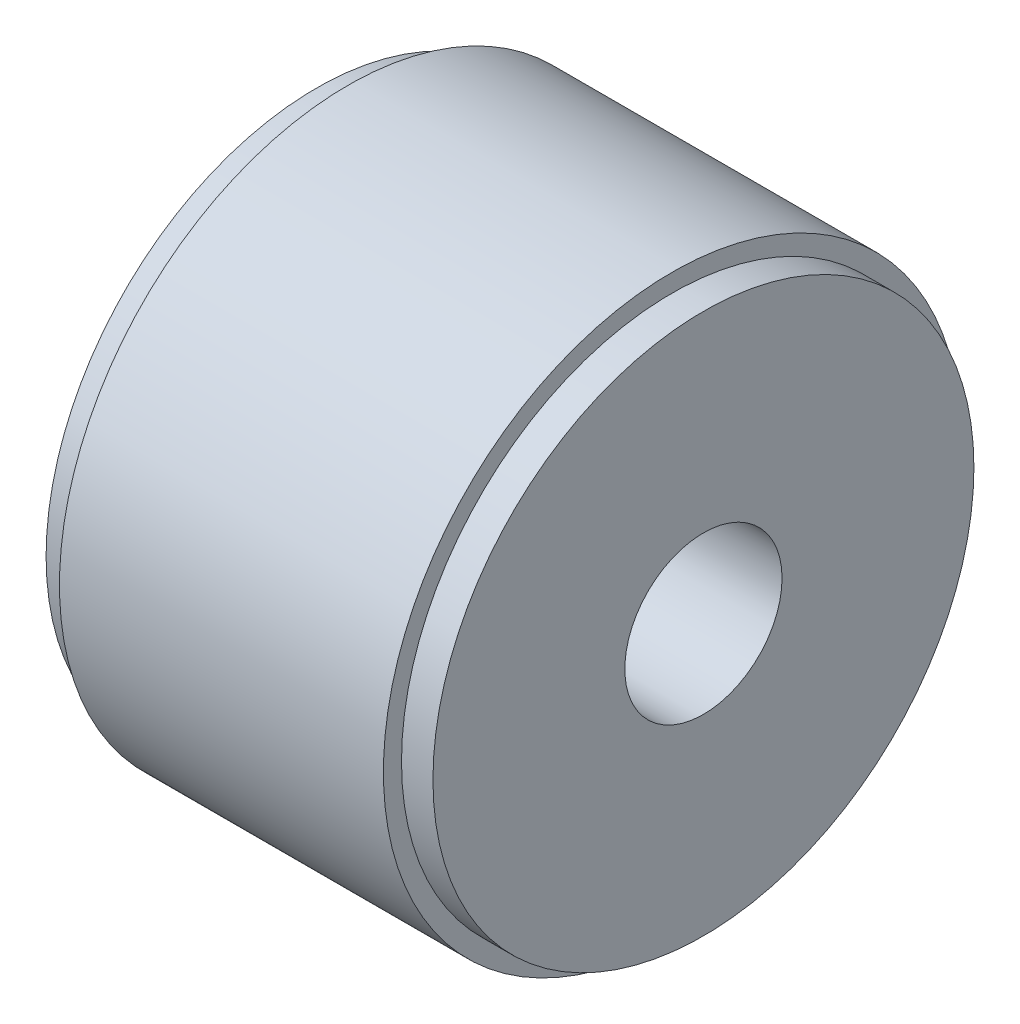
ISO-10303-21;
HEADER;
FILE_DESCRIPTION(('STEP AP214'),'2;1');
FILE_NAME('part.step','',(''),(''),'','','');
FILE_SCHEMA(('AUTOMOTIVE_DESIGN { 1 0 10303 214 1 1 1 1 }'));
ENDSEC;
DATA;
#1=APPLICATION_CONTEXT('core data for automotive mechanical design processes');
#2=APPLICATION_PROTOCOL_DEFINITION('international standard','automotive_design',2000,#1);
#3=PRODUCT_CONTEXT('',#1,'mechanical');
#4=PRODUCT('Part','Part','',(#3));
#5=PRODUCT_RELATED_PRODUCT_CATEGORY('part','',(#4));
#6=PRODUCT_DEFINITION_FORMATION('','',#4);
#7=PRODUCT_DEFINITION_CONTEXT('part definition',#1,'design');
#8=PRODUCT_DEFINITION('design','',#6,#7);
#9=PRODUCT_DEFINITION_SHAPE('','',#8);
#10=(LENGTH_UNIT() NAMED_UNIT(*) SI_UNIT(.MILLI.,.METRE.));
#11=(NAMED_UNIT(*) PLANE_ANGLE_UNIT() SI_UNIT($,.RADIAN.));
#12=(NAMED_UNIT(*) SI_UNIT($,.STERADIAN.) SOLID_ANGLE_UNIT());
#13=UNCERTAINTY_MEASURE_WITH_UNIT(LENGTH_MEASURE(1.E-05),#10,'distance_accuracy_value','');
#14=(GEOMETRIC_REPRESENTATION_CONTEXT(3) GLOBAL_UNCERTAINTY_ASSIGNED_CONTEXT((#13)) GLOBAL_UNIT_ASSIGNED_CONTEXT((#10,
#11,#12)) REPRESENTATION_CONTEXT('',''));
#15=CARTESIAN_POINT('',(0.,0.,0.));
#16=DIRECTION('',(0.,0.,1.));
#17=DIRECTION('',(1.,0.,0.));
#18=AXIS2_PLACEMENT_3D('',#15,#16,#17);
#19=CARTESIAN_POINT('',(-84.3214779404,-217.671164606,-140.1008397876));
#20=DIRECTION('',(1.,0.,0.));
#21=DIRECTION('',(0.,0.,-1.));
#22=AXIS2_PLACEMENT_3D('',#19,#20,#21);
#23=CYLINDRICAL_SURFACE('',#22,43.688);
#24=CARTESIAN_POINT('',(-84.3214779404,-217.671164606,-140.1008397876));
#25=DIRECTION('',(1.,0.,0.));
#26=DIRECTION('',(0.,0.,-1.));
#27=AXIS2_PLACEMENT_3D('',#24,#25,#26);
#28=CIRCLE('',#27,43.688);
#29=CARTESIAN_POINT('',(-84.3214779404,-217.671164606,-183.7888397876));
#30=VERTEX_POINT('',#29);
#31=EDGE_CURVE('E19',#30,#30,#28,.F.);
#32=ORIENTED_EDGE('',*,*,#31,.F.);
#33=EDGE_LOOP('',(#32));
#34=FACE_BOUND('',#33,.T.);
#35=CARTESIAN_POINT('',(-79.2414779404,-217.671164606,-140.1008397876));
#36=DIRECTION('',(1.,0.,0.));
#37=DIRECTION('',(0.,0.,-1.));
#38=AXIS2_PLACEMENT_3D('',#35,#36,#37);
#39=CIRCLE('',#38,43.688);
#40=CARTESIAN_POINT('',(-79.2414779404,-217.671164606,-183.7888397876));
#41=VERTEX_POINT('',#40);
#42=EDGE_CURVE('E41',#41,#41,#39,.T.);
#43=ORIENTED_EDGE('',*,*,#42,.F.);
#44=EDGE_LOOP('',(#43));
#45=FACE_BOUND('',#44,.T.);
#46=ADVANCED_FACE('F15',(#34,#45),#23,.T.);
#47=CARTESIAN_POINT('',(-84.3214779404,-264.839472606,-92.9325317876));
#48=DIRECTION('',(1.,0.,0.));
#49=DIRECTION('',(0.,0.,-1.));
#50=AXIS2_PLACEMENT_3D('',#47,#48,#49);
#51=PLANE('',#50);
#52=ORIENTED_EDGE('',*,*,#31,.T.);
#53=EDGE_LOOP('',(#52));
#54=FACE_BOUND('',#53,.T.);
#55=CARTESIAN_POINT('',(-84.3214779404,-217.671164606,-140.1008397876));
#56=DIRECTION('',(1.,0.,0.));
#57=DIRECTION('',(0.,0.,-1.));
#58=AXIS2_PLACEMENT_3D('',#55,#56,#57);
#59=CIRCLE('',#58,46.609);
#60=CARTESIAN_POINT('',(-84.3214779404,-217.671164606,-186.7098397876));
#61=VERTEX_POINT('',#60);
#62=EDGE_CURVE('E39',#61,#61,#59,.T.);
#63=ORIENTED_EDGE('',*,*,#62,.T.);
#64=EDGE_LOOP('',(#63));
#65=FACE_BOUND('',#64,.T.);
#66=ADVANCED_FACE('F48',(#54,#65),#51,.T.);
#67=CARTESIAN_POINT('',(-79.2414779404,-261.883420606,-95.8885837876));
#68=DIRECTION('',(1.,0.,0.));
#69=DIRECTION('',(0.,0.,-1.));
#70=AXIS2_PLACEMENT_3D('',#67,#68,#69);
#71=PLANE('',#70);
#72=CARTESIAN_POINT('',(-79.2414779404,-217.671164606,-140.1008397876));
#73=DIRECTION('',(1.,0.,0.));
#74=DIRECTION('',(0.,0.,-1.));
#75=AXIS2_PLACEMENT_3D('',#72,#73,#74);
#76=CIRCLE('',#75,12.7);
#77=CARTESIAN_POINT('',(-79.2414779404,-217.671164606,-152.8008397876));
#78=VERTEX_POINT('',#77);
#79=EDGE_CURVE('E36',#78,#78,#76,.T.);
#80=ORIENTED_EDGE('',*,*,#79,.F.);
#81=EDGE_LOOP('',(#80));
#82=FACE_BOUND('',#81,.T.);
#83=ORIENTED_EDGE('',*,*,#42,.T.);
#84=EDGE_LOOP('',(#83));
#85=FACE_BOUND('',#84,.T.);
#86=ADVANCED_FACE('F58',(#82,#85),#71,.T.);
#87=CARTESIAN_POINT('',(-136.6454779404,-217.671164606,-140.1008397876));
#88=DIRECTION('',(1.,0.,0.));
#89=DIRECTION('',(0.,0.,-1.));
#90=AXIS2_PLACEMENT_3D('',#87,#88,#89);
#91=CYLINDRICAL_SURFACE('',#90,46.609);
#92=CARTESIAN_POINT('',(-136.6454779404,-217.671164606,-140.1008397876));
#93=DIRECTION('',(1.,0.,0.));
#94=DIRECTION('',(0.,0.,-1.));
#95=AXIS2_PLACEMENT_3D('',#92,#93,#94);
#96=CIRCLE('',#95,46.609);
#97=CARTESIAN_POINT('',(-136.6454779404,-217.671164606,-186.7098397876));
#98=VERTEX_POINT('',#97);
#99=EDGE_CURVE('E33',#98,#98,#96,.F.);
#100=ORIENTED_EDGE('',*,*,#99,.F.);
#101=EDGE_LOOP('',(#100));
#102=FACE_BOUND('',#101,.T.);
#103=ORIENTED_EDGE('',*,*,#62,.F.);
#104=EDGE_LOOP('',(#103));
#105=FACE_BOUND('',#104,.T.);
#106=ADVANCED_FACE('F75',(#102,#105),#91,.T.);
#107=CARTESIAN_POINT('',(-141.7254779404,-217.671164606,-140.1008397876));
#108=DIRECTION('',(1.,0.,0.));
#109=DIRECTION('',(0.,0.,-1.));
#110=AXIS2_PLACEMENT_3D('',#107,#108,#109);
#111=CYLINDRICAL_SURFACE('',#110,12.7);
#112=ORIENTED_EDGE('',*,*,#79,.T.);
#113=EDGE_LOOP('',(#112));
#114=FACE_BOUND('',#113,.T.);
#115=CARTESIAN_POINT('',(-141.7254779404,-217.671164606,-140.1008397876));
#116=DIRECTION('',(1.,0.,0.));
#117=DIRECTION('',(0.,0.,-1.));
#118=AXIS2_PLACEMENT_3D('',#115,#116,#117);
#119=CIRCLE('',#118,12.7);
#120=CARTESIAN_POINT('',(-141.7254779404,-217.671164606,-152.8008397876));
#121=VERTEX_POINT('',#120);
#122=EDGE_CURVE('E28',#121,#121,#119,.T.);
#123=ORIENTED_EDGE('',*,*,#122,.F.);
#124=EDGE_LOOP('',(#123));
#125=FACE_BOUND('',#124,.T.);
#126=ADVANCED_FACE('F73',(#114,#125),#111,.F.);
#127=CARTESIAN_POINT('',(-136.6454779404,-264.839472606,-187.2691477876));
#128=DIRECTION('',(-1.,0.,0.));
#129=DIRECTION('',(0.,0.,1.));
#130=AXIS2_PLACEMENT_3D('',#127,#128,#129);
#131=PLANE('',#130);
#132=CARTESIAN_POINT('',(-136.6454779404,-217.671164606,-140.1008397876));
#133=DIRECTION('',(1.,0.,0.));
#134=DIRECTION('',(0.,0.,-1.));
#135=AXIS2_PLACEMENT_3D('',#132,#133,#134);
#136=CIRCLE('',#135,43.688);
#137=CARTESIAN_POINT('',(-136.6454779404,-217.671164606,-183.7888397876));
#138=VERTEX_POINT('',#137);
#139=EDGE_CURVE('E23',#138,#138,#136,.T.);
#140=ORIENTED_EDGE('',*,*,#139,.T.);
#141=EDGE_LOOP('',(#140));
#142=FACE_BOUND('',#141,.T.);
#143=ORIENTED_EDGE('',*,*,#99,.T.);
#144=EDGE_LOOP('',(#143));
#145=FACE_BOUND('',#144,.T.);
#146=ADVANCED_FACE('F68',(#142,#145),#131,.T.);
#147=CARTESIAN_POINT('',(-141.7254779404,-261.883420606,-184.3130957876));
#148=DIRECTION('',(-1.,0.,0.));
#149=DIRECTION('',(0.,0.,1.));
#150=AXIS2_PLACEMENT_3D('',#147,#148,#149);
#151=PLANE('',#150);
#152=ORIENTED_EDGE('',*,*,#122,.T.);
#153=EDGE_LOOP('',(#152));
#154=FACE_BOUND('',#153,.T.);
#155=CARTESIAN_POINT('',(-141.7254779404,-217.671164606,-140.1008397876));
#156=DIRECTION('',(1.,0.,0.));
#157=DIRECTION('',(0.,0.,-1.));
#158=AXIS2_PLACEMENT_3D('',#155,#156,#157);
#159=CIRCLE('',#158,43.688);
#160=CARTESIAN_POINT('',(-141.7254779404,-217.671164606,-183.7888397876));
#161=VERTEX_POINT('',#160);
#162=EDGE_CURVE('E10',#161,#161,#159,.F.);
#163=ORIENTED_EDGE('',*,*,#162,.T.);
#164=EDGE_LOOP('',(#163));
#165=FACE_BOUND('',#164,.T.);
#166=ADVANCED_FACE('F17',(#154,#165),#151,.T.);
#167=CARTESIAN_POINT('',(-141.7254779404,-217.671164606,-140.1008397876));
#168=DIRECTION('',(1.,0.,0.));
#169=DIRECTION('',(0.,0.,-1.));
#170=AXIS2_PLACEMENT_3D('',#167,#168,#169);
#171=CYLINDRICAL_SURFACE('',#170,43.688);
#172=ORIENTED_EDGE('',*,*,#139,.F.);
#173=EDGE_LOOP('',(#172));
#174=FACE_BOUND('',#173,.T.);
#175=ORIENTED_EDGE('',*,*,#162,.F.);
#176=EDGE_LOOP('',(#175));
#177=FACE_BOUND('',#176,.T.);
#178=ADVANCED_FACE('F61',(#174,#177),#171,.T.);
#179=CLOSED_SHELL('',(#46,#66,#86,#106,#126,#146,#166,#178));
#180=MANIFOLD_SOLID_BREP('B1',#179);
#181=ADVANCED_BREP_SHAPE_REPRESENTATION('',(#18,#180),#14);
#182=SHAPE_DEFINITION_REPRESENTATION(#9,#181);
ENDSEC;
END-ISO-10303-21;
